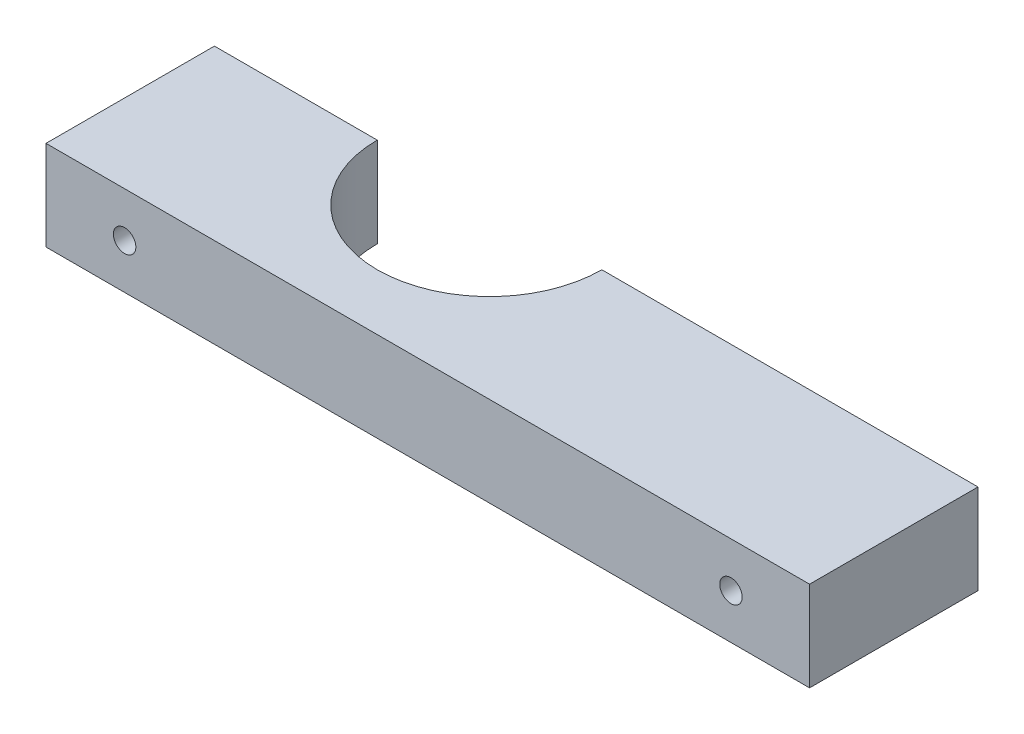
ISO-10303-21;
HEADER;
FILE_DESCRIPTION(('STEP AP214'),'2;1');
FILE_NAME('part.step','',(''),(''),'','','');
FILE_SCHEMA(('AUTOMOTIVE_DESIGN { 1 0 10303 214 1 1 1 1 }'));
ENDSEC;
DATA;
#1=APPLICATION_CONTEXT('core data for automotive mechanical design processes');
#2=APPLICATION_PROTOCOL_DEFINITION('international standard','automotive_design',2000,#1);
#3=PRODUCT_CONTEXT('',#1,'mechanical');
#4=PRODUCT('Part','Part','',(#3));
#5=PRODUCT_RELATED_PRODUCT_CATEGORY('part','',(#4));
#6=PRODUCT_DEFINITION_FORMATION('','',#4);
#7=PRODUCT_DEFINITION_CONTEXT('part definition',#1,'design');
#8=PRODUCT_DEFINITION('design','',#6,#7);
#9=PRODUCT_DEFINITION_SHAPE('','',#8);
#10=(LENGTH_UNIT() NAMED_UNIT(*) SI_UNIT(.MILLI.,.METRE.));
#11=(NAMED_UNIT(*) PLANE_ANGLE_UNIT() SI_UNIT($,.RADIAN.));
#12=(NAMED_UNIT(*) SI_UNIT($,.STERADIAN.) SOLID_ANGLE_UNIT());
#13=UNCERTAINTY_MEASURE_WITH_UNIT(LENGTH_MEASURE(1.E-05),#10,'distance_accuracy_value','');
#14=(GEOMETRIC_REPRESENTATION_CONTEXT(3) GLOBAL_UNCERTAINTY_ASSIGNED_CONTEXT((#13)) GLOBAL_UNIT_ASSIGNED_CONTEXT((#10,
#11,#12)) REPRESENTATION_CONTEXT('',''));
#15=CARTESIAN_POINT('',(0.,0.,0.));
#16=DIRECTION('',(0.,0.,1.));
#17=DIRECTION('',(1.,0.,0.));
#18=AXIS2_PLACEMENT_3D('',#15,#16,#17);
#19=CARTESIAN_POINT('',(-31.8506711409396,8.,0.340604026845638));
#20=DIRECTION('',(1.,0.,0.));
#21=DIRECTION('',(0.,0.,-1.));
#22=AXIS2_PLACEMENT_3D('',#19,#20,#21);
#23=PLANE('',#22);
#24=DIRECTION('',(0.,0.,1.));
#25=VECTOR('',#24,1.);
#26=CARTESIAN_POINT('',(-31.8506711409396,0.,0.340604026845638));
#27=LINE('',#26,#25);
#28=CARTESIAN_POINT('',(-31.8506711409396,0.,0.340604026845638));
#29=VERTEX_POINT('',#28);
#30=CARTESIAN_POINT('',(-31.8506711409396,0.,15.3406040268456));
#31=VERTEX_POINT('',#30);
#32=EDGE_CURVE('E118',#29,#31,#27,.T.);
#33=ORIENTED_EDGE('',*,*,#32,.T.);
#34=DIRECTION('',(0.,-1.,0.));
#35=VECTOR('',#34,1.);
#36=CARTESIAN_POINT('',(-31.8506711409396,8.,15.3406040268456));
#37=LINE('',#36,#35);
#38=CARTESIAN_POINT('',(-31.8506711409396,8.,15.3406040268456));
#39=VERTEX_POINT('',#38);
#40=EDGE_CURVE('E11',#39,#31,#37,.T.);
#41=ORIENTED_EDGE('',*,*,#40,.F.);
#42=DIRECTION('',(0.,0.,1.));
#43=VECTOR('',#42,1.);
#44=CARTESIAN_POINT('',(-31.8506711409396,8.,0.340604026845638));
#45=LINE('',#44,#43);
#46=CARTESIAN_POINT('',(-31.8506711409396,8.,0.340604026845638));
#47=VERTEX_POINT('',#46);
#48=EDGE_CURVE('E129',#47,#39,#45,.T.);
#49=ORIENTED_EDGE('',*,*,#48,.F.);
#50=DIRECTION('',(0.,-1.,0.));
#51=VECTOR('',#50,1.);
#52=CARTESIAN_POINT('',(-31.8506711409396,8.,0.340604026845638));
#53=LINE('',#52,#51);
#54=EDGE_CURVE('E114',#47,#29,#53,.T.);
#55=ORIENTED_EDGE('',*,*,#54,.T.);
#56=EDGE_LOOP('',(#33,#41,#49,#55));
#57=FACE_BOUND('',#56,.T.);
#58=ADVANCED_FACE('F32',(#57),#23,.F.);
#59=CARTESIAN_POINT('',(-31.8506711409396,8.,15.3406040268456));
#60=DIRECTION('',(0.,0.,-1.));
#61=DIRECTION('',(-1.,0.,0.));
#62=AXIS2_PLACEMENT_3D('',#59,#60,#61);
#63=PLANE('',#62);
#64=CARTESIAN_POINT('',(29.1493288590604,4.,15.3406040268456));
#65=DIRECTION('',(0.,0.,1.));
#66=DIRECTION('',(1.,0.,0.));
#67=AXIS2_PLACEMENT_3D('',#64,#65,#66);
#68=CIRCLE('',#67,0.999999999999998);
#69=CARTESIAN_POINT('',(30.1493288590604,4.,15.3406040268456));
#70=VERTEX_POINT('',#69);
#71=EDGE_CURVE('E143',#70,#70,#68,.T.);
#72=ORIENTED_EDGE('',*,*,#71,.F.);
#73=EDGE_LOOP('',(#72));
#74=FACE_BOUND('',#73,.T.);
#75=CARTESIAN_POINT('',(-24.8506711409396,4.,15.3406040268456));
#76=DIRECTION('',(0.,0.,1.));
#77=DIRECTION('',(1.,0.,0.));
#78=AXIS2_PLACEMENT_3D('',#75,#76,#77);
#79=CIRCLE('',#78,1.);
#80=CARTESIAN_POINT('',(-23.8506711409396,4.,15.3406040268456));
#81=VERTEX_POINT('',#80);
#82=EDGE_CURVE('E135',#81,#81,#79,.T.);
#83=ORIENTED_EDGE('',*,*,#82,.F.);
#84=EDGE_LOOP('',(#83));
#85=FACE_BOUND('',#84,.T.);
#86=DIRECTION('',(1.,0.,0.));
#87=VECTOR('',#86,1.);
#88=CARTESIAN_POINT('',(-31.8506711409396,0.,15.3406040268456));
#89=LINE('',#88,#87);
#90=CARTESIAN_POINT('',(36.1493288590604,0.,15.3406040268456));
#91=VERTEX_POINT('',#90);
#92=EDGE_CURVE('E121',#31,#91,#89,.T.);
#93=ORIENTED_EDGE('',*,*,#92,.T.);
#94=DIRECTION('',(0.,-1.,0.));
#95=VECTOR('',#94,1.);
#96=CARTESIAN_POINT('',(36.1493288590604,8.,15.3406040268456));
#97=LINE('',#96,#95);
#98=CARTESIAN_POINT('',(36.1493288590604,8.,15.3406040268456));
#99=VERTEX_POINT('',#98);
#100=EDGE_CURVE('E41',#99,#91,#97,.T.);
#101=ORIENTED_EDGE('',*,*,#100,.F.);
#102=DIRECTION('',(1.,0.,0.));
#103=VECTOR('',#102,1.);
#104=CARTESIAN_POINT('',(-31.8506711409396,8.,15.3406040268456));
#105=LINE('',#104,#103);
#106=EDGE_CURVE('E87',#39,#99,#105,.T.);
#107=ORIENTED_EDGE('',*,*,#106,.F.);
#108=ORIENTED_EDGE('',*,*,#40,.T.);
#109=EDGE_LOOP('',(#93,#101,#107,#108));
#110=FACE_BOUND('',#109,.T.);
#111=ADVANCED_FACE('F149',(#74,#85,#110),#63,.F.);
#112=CARTESIAN_POINT('',(36.1493288590604,8.,0.340604026845638));
#113=DIRECTION('',(-1.,0.,0.));
#114=DIRECTION('',(0.,0.,1.));
#115=AXIS2_PLACEMENT_3D('',#112,#113,#114);
#116=PLANE('',#115);
#117=DIRECTION('',(0.,0.,-1.));
#118=VECTOR('',#117,1.);
#119=CARTESIAN_POINT('',(36.1493288590604,0.,0.340604026845638));
#120=LINE('',#119,#118);
#121=CARTESIAN_POINT('',(36.1493288590604,0.,0.340604026845638));
#122=VERTEX_POINT('',#121);
#123=EDGE_CURVE('E124',#91,#122,#120,.T.);
#124=ORIENTED_EDGE('',*,*,#123,.T.);
#125=DIRECTION('',(0.,-1.,0.));
#126=VECTOR('',#125,1.);
#127=CARTESIAN_POINT('',(36.1493288590604,8.,0.340604026845638));
#128=LINE('',#127,#126);
#129=CARTESIAN_POINT('',(36.1493288590604,8.,0.340604026845638));
#130=VERTEX_POINT('',#129);
#131=EDGE_CURVE('E109',#130,#122,#128,.T.);
#132=ORIENTED_EDGE('',*,*,#131,.F.);
#133=DIRECTION('',(0.,0.,-1.));
#134=VECTOR('',#133,1.);
#135=CARTESIAN_POINT('',(36.1493288590604,8.,0.340604026845638));
#136=LINE('',#135,#134);
#137=EDGE_CURVE('E100',#99,#130,#136,.T.);
#138=ORIENTED_EDGE('',*,*,#137,.F.);
#139=ORIENTED_EDGE('',*,*,#100,.T.);
#140=EDGE_LOOP('',(#124,#132,#138,#139));
#141=FACE_BOUND('',#140,.T.);
#142=ADVANCED_FACE('F152',(#141),#116,.F.);
#143=CARTESIAN_POINT('',(2.64932885906042,8.,0.340604026845638));
#144=DIRECTION('',(0.,0.,1.));
#145=DIRECTION('',(1.,0.,0.));
#146=AXIS2_PLACEMENT_3D('',#143,#144,#145);
#147=PLANE('',#146);
#148=CARTESIAN_POINT('',(29.1493288590604,4.,0.340604026845638));
#149=DIRECTION('',(0.,0.,1.));
#150=DIRECTION('',(1.,0.,0.));
#151=AXIS2_PLACEMENT_3D('',#148,#149,#150);
#152=CIRCLE('',#151,0.999999999999998);
#153=CARTESIAN_POINT('',(30.1493288590604,4.,0.340604026845638));
#154=VERTEX_POINT('',#153);
#155=EDGE_CURVE('E35',#154,#154,#152,.F.);
#156=ORIENTED_EDGE('',*,*,#155,.F.);
#157=EDGE_LOOP('',(#156));
#158=FACE_BOUND('',#157,.T.);
#159=DIRECTION('',(-1.,0.,0.));
#160=VECTOR('',#159,1.);
#161=CARTESIAN_POINT('',(2.64932885906042,0.,0.340604026845638));
#162=LINE('',#161,#160);
#163=CARTESIAN_POINT('',(2.64932885906042,0.,0.340604026845639));
#164=VERTEX_POINT('',#163);
#165=EDGE_CURVE('E108',#122,#164,#162,.T.);
#166=ORIENTED_EDGE('',*,*,#165,.T.);
#167=DIRECTION('',(0.,-1.,0.));
#168=VECTOR('',#167,1.);
#169=CARTESIAN_POINT('',(2.64932885906042,8.,0.340604026845639));
#170=LINE('',#169,#168);
#171=CARTESIAN_POINT('',(2.64932885906042,8.,0.340604026845639));
#172=VERTEX_POINT('',#171);
#173=EDGE_CURVE('E105',#172,#164,#170,.T.);
#174=ORIENTED_EDGE('',*,*,#173,.F.);
#175=DIRECTION('',(-1.,0.,0.));
#176=VECTOR('',#175,1.);
#177=CARTESIAN_POINT('',(2.64932885906042,8.,0.340604026845638));
#178=LINE('',#177,#176);
#179=EDGE_CURVE('E94',#130,#172,#178,.T.);
#180=ORIENTED_EDGE('',*,*,#179,.F.);
#181=ORIENTED_EDGE('',*,*,#131,.T.);
#182=EDGE_LOOP('',(#166,#174,#180,#181));
#183=FACE_BOUND('',#182,.T.);
#184=ADVANCED_FACE('F106',(#158,#183),#147,.F.);
#185=CARTESIAN_POINT('',(-7.35067114093958,8.,0.340604026845638));
#186=DIRECTION('',(0.,-1.,0.));
#187=DIRECTION('',(0.,0.,-1.));
#188=AXIS2_PLACEMENT_3D('',#185,#186,#187);
#189=CYLINDRICAL_SURFACE('',#188,10.);
#190=CARTESIAN_POINT('',(-7.35067114093958,0.,0.340604026845638));
#191=DIRECTION('',(0.,-1.,0.));
#192=DIRECTION('',(0.,0.,1.));
#193=AXIS2_PLACEMENT_3D('',#190,#191,#192);
#194=CIRCLE('',#193,10.);
#195=CARTESIAN_POINT('',(-17.3506711409396,0.,0.340604026845638));
#196=VERTEX_POINT('',#195);
#197=EDGE_CURVE('E73',#164,#196,#194,.T.);
#198=ORIENTED_EDGE('',*,*,#197,.T.);
#199=DIRECTION('',(0.,-1.,0.));
#200=VECTOR('',#199,1.);
#201=CARTESIAN_POINT('',(-17.3506711409396,8.,0.340604026845638));
#202=LINE('',#201,#200);
#203=CARTESIAN_POINT('',(-17.3506711409396,8.,0.340604026845638));
#204=VERTEX_POINT('',#203);
#205=EDGE_CURVE('E110',#204,#196,#202,.T.);
#206=ORIENTED_EDGE('',*,*,#205,.F.);
#207=CARTESIAN_POINT('',(-7.35067114093958,8.,0.340604026845638));
#208=DIRECTION('',(0.,-1.,0.));
#209=DIRECTION('',(0.,0.,1.));
#210=AXIS2_PLACEMENT_3D('',#207,#208,#209);
#211=CIRCLE('',#210,10.);
#212=EDGE_CURVE('E98',#172,#204,#211,.T.);
#213=ORIENTED_EDGE('',*,*,#212,.F.);
#214=ORIENTED_EDGE('',*,*,#173,.T.);
#215=EDGE_LOOP('',(#198,#206,#213,#214));
#216=FACE_BOUND('',#215,.T.);
#217=ADVANCED_FACE('F112',(#216),#189,.F.);
#218=CARTESIAN_POINT('',(-31.8506711409396,8.,0.340604026845638));
#219=DIRECTION('',(0.,0.,1.));
#220=DIRECTION('',(1.,0.,0.));
#221=AXIS2_PLACEMENT_3D('',#218,#219,#220);
#222=PLANE('',#221);
#223=CARTESIAN_POINT('',(-24.8506711409396,4.,0.340604026845638));
#224=DIRECTION('',(0.,0.,1.));
#225=DIRECTION('',(1.,0.,0.));
#226=AXIS2_PLACEMENT_3D('',#223,#224,#225);
#227=CIRCLE('',#226,1.);
#228=CARTESIAN_POINT('',(-23.8506711409396,4.,0.340604026845638));
#229=VERTEX_POINT('',#228);
#230=EDGE_CURVE('E122',#229,#229,#227,.F.);
#231=ORIENTED_EDGE('',*,*,#230,.F.);
#232=EDGE_LOOP('',(#231));
#233=FACE_BOUND('',#232,.T.);
#234=DIRECTION('',(-1.,0.,0.));
#235=VECTOR('',#234,1.);
#236=CARTESIAN_POINT('',(-31.8506711409396,0.,0.340604026845638));
#237=LINE('',#236,#235);
#238=EDGE_CURVE('E79',#196,#29,#237,.T.);
#239=ORIENTED_EDGE('',*,*,#238,.T.);
#240=ORIENTED_EDGE('',*,*,#54,.F.);
#241=DIRECTION('',(-1.,0.,0.));
#242=VECTOR('',#241,1.);
#243=CARTESIAN_POINT('',(-31.8506711409396,8.,0.340604026845638));
#244=LINE('',#243,#242);
#245=EDGE_CURVE('E50',#204,#47,#244,.T.);
#246=ORIENTED_EDGE('',*,*,#245,.F.);
#247=ORIENTED_EDGE('',*,*,#205,.T.);
#248=EDGE_LOOP('',(#239,#240,#246,#247));
#249=FACE_BOUND('',#248,.T.);
#250=ADVANCED_FACE('F157',(#233,#249),#222,.F.);
#251=CARTESIAN_POINT('',(-7.35067114093958,8.,0.340604026845638));
#252=DIRECTION('',(0.,1.,0.));
#253=DIRECTION('',(0.,0.,1.));
#254=AXIS2_PLACEMENT_3D('',#251,#252,#253);
#255=PLANE('',#254);
#256=ORIENTED_EDGE('',*,*,#48,.T.);
#257=ORIENTED_EDGE('',*,*,#106,.T.);
#258=ORIENTED_EDGE('',*,*,#137,.T.);
#259=ORIENTED_EDGE('',*,*,#179,.T.);
#260=ORIENTED_EDGE('',*,*,#212,.T.);
#261=ORIENTED_EDGE('',*,*,#245,.T.);
#262=EDGE_LOOP('',(#256,#257,#258,#259,#260,#261));
#263=FACE_BOUND('',#262,.T.);
#264=ADVANCED_FACE('F96',(#263),#255,.T.);
#265=CARTESIAN_POINT('',(-7.35067114093958,0.,0.340604026845638));
#266=DIRECTION('',(0.,1.,0.));
#267=DIRECTION('',(0.,0.,1.));
#268=AXIS2_PLACEMENT_3D('',#265,#266,#267);
#269=PLANE('',#268);
#270=ORIENTED_EDGE('',*,*,#32,.F.);
#271=ORIENTED_EDGE('',*,*,#238,.F.);
#272=ORIENTED_EDGE('',*,*,#197,.F.);
#273=ORIENTED_EDGE('',*,*,#165,.F.);
#274=ORIENTED_EDGE('',*,*,#123,.F.);
#275=ORIENTED_EDGE('',*,*,#92,.F.);
#276=EDGE_LOOP('',(#270,#271,#272,#273,#274,#275));
#277=FACE_BOUND('',#276,.T.);
#278=ADVANCED_FACE('F155',(#277),#269,.F.);
#279=CARTESIAN_POINT('',(-24.8506711409396,4.,15.3406040268456));
#280=DIRECTION('',(0.,0.,-1.));
#281=DIRECTION('',(-1.,0.,0.));
#282=AXIS2_PLACEMENT_3D('',#279,#280,#281);
#283=CYLINDRICAL_SURFACE('',#282,1.);
#284=ORIENTED_EDGE('',*,*,#82,.T.);
#285=EDGE_LOOP('',(#284));
#286=FACE_BOUND('',#285,.T.);
#287=ORIENTED_EDGE('',*,*,#230,.T.);
#288=EDGE_LOOP('',(#287));
#289=FACE_BOUND('',#288,.T.);
#290=ADVANCED_FACE('F188',(#286,#289),#283,.F.);
#291=CARTESIAN_POINT('',(29.1493288590604,4.,15.3406040268456));
#292=DIRECTION('',(0.,0.,-1.));
#293=DIRECTION('',(-1.,0.,0.));
#294=AXIS2_PLACEMENT_3D('',#291,#292,#293);
#295=CYLINDRICAL_SURFACE('',#294,0.999999999999998);
#296=ORIENTED_EDGE('',*,*,#71,.T.);
#297=EDGE_LOOP('',(#296));
#298=FACE_BOUND('',#297,.T.);
#299=ORIENTED_EDGE('',*,*,#155,.T.);
#300=EDGE_LOOP('',(#299));
#301=FACE_BOUND('',#300,.T.);
#302=ADVANCED_FACE('F186',(#298,#301),#295,.F.);
#303=CLOSED_SHELL('',(#58,#111,#142,#184,#217,#250,#264,#278,#290,#302));
#304=MANIFOLD_SOLID_BREP('B2',#303);
#305=ADVANCED_BREP_SHAPE_REPRESENTATION('',(#18,#304),#14);
#306=SHAPE_DEFINITION_REPRESENTATION(#9,#305);
ENDSEC;
END-ISO-10303-21;
